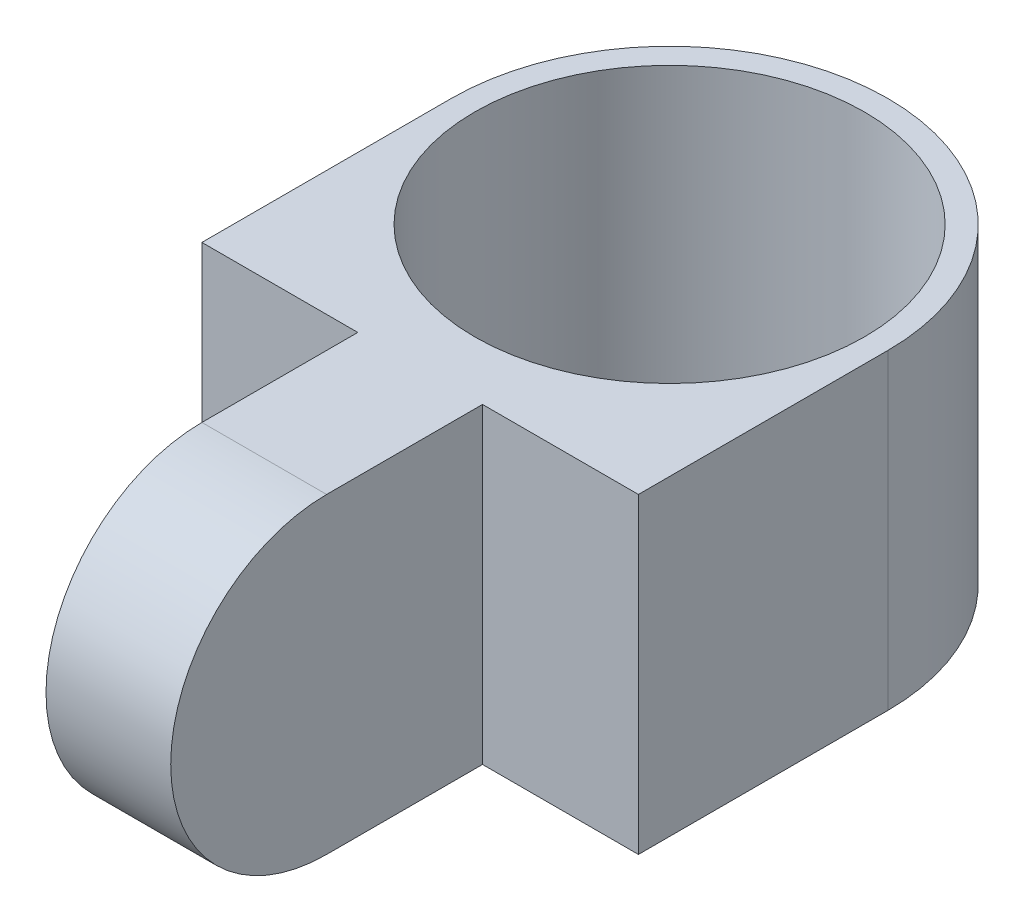
ISO-10303-21;
HEADER;
FILE_DESCRIPTION(('STEP AP214'),'2;1');
FILE_NAME('part.step','',(''),(''),'','','');
FILE_SCHEMA(('AUTOMOTIVE_DESIGN { 1 0 10303 214 1 1 1 1 }'));
ENDSEC;
DATA;
#1=APPLICATION_CONTEXT('core data for automotive mechanical design processes');
#2=APPLICATION_PROTOCOL_DEFINITION('international standard','automotive_design',2000,#1);
#3=PRODUCT_CONTEXT('',#1,'mechanical');
#4=PRODUCT('Part','Part','',(#3));
#5=PRODUCT_RELATED_PRODUCT_CATEGORY('part','',(#4));
#6=PRODUCT_DEFINITION_FORMATION('','',#4);
#7=PRODUCT_DEFINITION_CONTEXT('part definition',#1,'design');
#8=PRODUCT_DEFINITION('design','',#6,#7);
#9=PRODUCT_DEFINITION_SHAPE('','',#8);
#10=(LENGTH_UNIT() NAMED_UNIT(*) SI_UNIT(.MILLI.,.METRE.));
#11=(NAMED_UNIT(*) PLANE_ANGLE_UNIT() SI_UNIT($,.RADIAN.));
#12=(NAMED_UNIT(*) SI_UNIT($,.STERADIAN.) SOLID_ANGLE_UNIT());
#13=UNCERTAINTY_MEASURE_WITH_UNIT(LENGTH_MEASURE(1.E-05),#10,'distance_accuracy_value','');
#14=(GEOMETRIC_REPRESENTATION_CONTEXT(3) GLOBAL_UNCERTAINTY_ASSIGNED_CONTEXT((#13)) GLOBAL_UNIT_ASSIGNED_CONTEXT((#10,
#11,#12)) REPRESENTATION_CONTEXT('',''));
#15=CARTESIAN_POINT('',(0.,0.,0.));
#16=DIRECTION('',(0.,0.,1.));
#17=DIRECTION('',(1.,0.,0.));
#18=AXIS2_PLACEMENT_3D('',#15,#16,#17);
#19=CARTESIAN_POINT('',(0.,0.,8.));
#20=DIRECTION('',(0.,0.,1.));
#21=DIRECTION('',(1.,0.,0.));
#22=AXIS2_PLACEMENT_3D('',#19,#20,#21);
#23=PLANE('',#22);
#24=DIRECTION('',(1.,0.,0.));
#25=VECTOR('',#24,1.);
#26=CARTESIAN_POINT('',(-7.,0.,8.));
#27=LINE('',#26,#25);
#28=CARTESIAN_POINT('',(-7.,0.,8.));
#29=VERTEX_POINT('',#28);
#30=CARTESIAN_POINT('',(-2.,0.,8.));
#31=VERTEX_POINT('',#30);
#32=EDGE_CURVE('E222',#29,#31,#27,.T.);
#33=ORIENTED_EDGE('',*,*,#32,.T.);
#34=DIRECTION('',(0.,1.,0.));
#35=VECTOR('',#34,1.);
#36=CARTESIAN_POINT('',(-2.,10.,8.));
#37=LINE('',#36,#35);
#38=CARTESIAN_POINT('',(-2.,10.,8.));
#39=VERTEX_POINT('',#38);
#40=EDGE_CURVE('E227',#31,#39,#37,.T.);
#41=ORIENTED_EDGE('',*,*,#40,.T.);
#42=DIRECTION('',(-1.,0.,0.));
#43=VECTOR('',#42,1.);
#44=CARTESIAN_POINT('',(-7.,10.,8.));
#45=LINE('',#44,#43);
#46=CARTESIAN_POINT('',(-7.,10.,8.));
#47=VERTEX_POINT('',#46);
#48=EDGE_CURVE('E137',#39,#47,#45,.T.);
#49=ORIENTED_EDGE('',*,*,#48,.T.);
#50=DIRECTION('',(0.,-1.,0.));
#51=VECTOR('',#50,1.);
#52=CARTESIAN_POINT('',(-7.,10.,8.));
#53=LINE('',#52,#51);
#54=EDGE_CURVE('E155',#47,#29,#53,.T.);
#55=ORIENTED_EDGE('',*,*,#54,.T.);
#56=EDGE_LOOP('',(#33,#41,#49,#55));
#57=FACE_BOUND('',#56,.T.);
#58=ADVANCED_FACE('F43',(#57),#23,.T.);
#59=CARTESIAN_POINT('',(0.,10.,0.));
#60=DIRECTION('',(0.,-1.,0.));
#61=DIRECTION('',(0.,0.,-1.));
#62=AXIS2_PLACEMENT_3D('',#59,#60,#61);
#63=CYLINDRICAL_SURFACE('',#62,7.);
#64=DIRECTION('',(0.,-1.,0.));
#65=VECTOR('',#64,1.);
#66=CARTESIAN_POINT('',(-7.,10.,0.));
#67=LINE('',#66,#65);
#68=CARTESIAN_POINT('',(-7.,10.,0.));
#69=VERTEX_POINT('',#68);
#70=CARTESIAN_POINT('',(-7.,0.,0.));
#71=VERTEX_POINT('',#70);
#72=EDGE_CURVE('E147',#69,#71,#67,.T.);
#73=ORIENTED_EDGE('',*,*,#72,.F.);
#74=CARTESIAN_POINT('',(0.,10.,0.));
#75=DIRECTION('',(0.,1.,0.));
#76=DIRECTION('',(0.,0.,1.));
#77=AXIS2_PLACEMENT_3D('',#74,#75,#76);
#78=CIRCLE('',#77,7.);
#79=CARTESIAN_POINT('',(7.,10.,0.));
#80=VERTEX_POINT('',#79);
#81=EDGE_CURVE('E11',#80,#69,#78,.T.);
#82=ORIENTED_EDGE('',*,*,#81,.F.);
#83=DIRECTION('',(0.,1.,0.));
#84=VECTOR('',#83,1.);
#85=CARTESIAN_POINT('',(7.,10.,0.));
#86=LINE('',#85,#84);
#87=CARTESIAN_POINT('',(7.,0.,0.));
#88=VERTEX_POINT('',#87);
#89=EDGE_CURVE('E151',#88,#80,#86,.T.);
#90=ORIENTED_EDGE('',*,*,#89,.F.);
#91=CARTESIAN_POINT('',(0.,0.,0.));
#92=DIRECTION('',(0.,1.,0.));
#93=DIRECTION('',(0.,0.,1.));
#94=AXIS2_PLACEMENT_3D('',#91,#92,#93);
#95=CIRCLE('',#94,7.);
#96=EDGE_CURVE('E47',#88,#71,#95,.T.);
#97=ORIENTED_EDGE('',*,*,#96,.T.);
#98=EDGE_LOOP('',(#73,#82,#90,#97));
#99=FACE_BOUND('',#98,.T.);
#100=ADVANCED_FACE('F45',(#99),#63,.T.);
#101=CARTESIAN_POINT('',(0.,10.,0.));
#102=DIRECTION('',(0.,-1.,0.));
#103=DIRECTION('',(0.,0.,-1.));
#104=AXIS2_PLACEMENT_3D('',#101,#102,#103);
#105=CYLINDRICAL_SURFACE('',#104,6.25);
#106=CARTESIAN_POINT('',(0.,10.,0.));
#107=DIRECTION('',(0.,1.,0.));
#108=DIRECTION('',(0.,0.,1.));
#109=AXIS2_PLACEMENT_3D('',#106,#107,#108);
#110=CIRCLE('',#109,6.25);
#111=CARTESIAN_POINT('',(0.,10.,6.25));
#112=VERTEX_POINT('',#111);
#113=EDGE_CURVE('E167',#112,#112,#110,.T.);
#114=ORIENTED_EDGE('',*,*,#113,.T.);
#115=EDGE_LOOP('',(#114));
#116=FACE_BOUND('',#115,.T.);
#117=CARTESIAN_POINT('',(0.,0.,0.));
#118=DIRECTION('',(0.,1.,0.));
#119=DIRECTION('',(0.,0.,1.));
#120=AXIS2_PLACEMENT_3D('',#117,#118,#119);
#121=CIRCLE('',#120,6.25);
#122=CARTESIAN_POINT('',(0.,0.,6.25));
#123=VERTEX_POINT('',#122);
#124=EDGE_CURVE('E166',#123,#123,#121,.T.);
#125=ORIENTED_EDGE('',*,*,#124,.F.);
#126=EDGE_LOOP('',(#125));
#127=FACE_BOUND('',#126,.T.);
#128=ADVANCED_FACE('F178',(#116,#127),#105,.F.);
#129=CARTESIAN_POINT('',(0.,10.,0.));
#130=DIRECTION('',(0.,1.,0.));
#131=DIRECTION('',(0.,0.,1.));
#132=AXIS2_PLACEMENT_3D('',#129,#130,#131);
#133=PLANE('',#132);
#134=ORIENTED_EDGE('',*,*,#113,.F.);
#135=EDGE_LOOP('',(#134));
#136=FACE_BOUND('',#135,.T.);
#137=ORIENTED_EDGE('',*,*,#81,.T.);
#138=DIRECTION('',(0.,0.,-1.));
#139=VECTOR('',#138,1.);
#140=CARTESIAN_POINT('',(-7.,10.,8.));
#141=LINE('',#140,#139);
#142=EDGE_CURVE('E136',#47,#69,#141,.T.);
#143=ORIENTED_EDGE('',*,*,#142,.F.);
#144=ORIENTED_EDGE('',*,*,#48,.F.);
#145=DIRECTION('',(0.,0.,1.));
#146=VECTOR('',#145,1.);
#147=CARTESIAN_POINT('',(-2.,10.,8.));
#148=LINE('',#147,#146);
#149=CARTESIAN_POINT('',(-2.,10.,13.));
#150=VERTEX_POINT('',#149);
#151=EDGE_CURVE('E59',#39,#150,#148,.T.);
#152=ORIENTED_EDGE('',*,*,#151,.T.);
#153=DIRECTION('',(1.,0.,0.));
#154=VECTOR('',#153,1.);
#155=CARTESIAN_POINT('',(-2.,10.,13.));
#156=LINE('',#155,#154);
#157=CARTESIAN_POINT('',(2.,10.,13.));
#158=VERTEX_POINT('',#157);
#159=EDGE_CURVE('E115',#150,#158,#156,.T.);
#160=ORIENTED_EDGE('',*,*,#159,.T.);
#161=DIRECTION('',(0.,0.,1.));
#162=VECTOR('',#161,1.);
#163=CARTESIAN_POINT('',(2.,10.,8.));
#164=LINE('',#163,#162);
#165=CARTESIAN_POINT('',(2.,10.,8.));
#166=VERTEX_POINT('',#165);
#167=EDGE_CURVE('E109',#166,#158,#164,.T.);
#168=ORIENTED_EDGE('',*,*,#167,.F.);
#169=CARTESIAN_POINT('',(7.,10.,8.));
#170=VERTEX_POINT('',#169);
#171=EDGE_CURVE('E114',#170,#166,#45,.T.);
#172=ORIENTED_EDGE('',*,*,#171,.F.);
#173=DIRECTION('',(0.,0.,-1.));
#174=VECTOR('',#173,1.);
#175=CARTESIAN_POINT('',(7.,10.,8.));
#176=LINE('',#175,#174);
#177=EDGE_CURVE('E142',#170,#80,#176,.T.);
#178=ORIENTED_EDGE('',*,*,#177,.T.);
#179=EDGE_LOOP('',(#137,#143,#144,#152,#160,#168,#172,#178));
#180=FACE_BOUND('',#179,.T.);
#181=ADVANCED_FACE('F111',(#136,#180),#133,.T.);
#182=CARTESIAN_POINT('',(0.,0.,0.));
#183=DIRECTION('',(0.,1.,0.));
#184=DIRECTION('',(0.,0.,1.));
#185=AXIS2_PLACEMENT_3D('',#182,#183,#184);
#186=PLANE('',#185);
#187=ORIENTED_EDGE('',*,*,#124,.T.);
#188=EDGE_LOOP('',(#187));
#189=FACE_BOUND('',#188,.T.);
#190=DIRECTION('',(0.,0.,-1.));
#191=VECTOR('',#190,1.);
#192=CARTESIAN_POINT('',(-7.,0.,8.));
#193=LINE('',#192,#191);
#194=EDGE_CURVE('E163',#29,#71,#193,.T.);
#195=ORIENTED_EDGE('',*,*,#194,.T.);
#196=ORIENTED_EDGE('',*,*,#96,.F.);
#197=DIRECTION('',(0.,0.,-1.));
#198=VECTOR('',#197,1.);
#199=CARTESIAN_POINT('',(7.,0.,8.));
#200=LINE('',#199,#198);
#201=CARTESIAN_POINT('',(7.,0.,8.));
#202=VERTEX_POINT('',#201);
#203=EDGE_CURVE('E159',#202,#88,#200,.T.);
#204=ORIENTED_EDGE('',*,*,#203,.F.);
#205=CARTESIAN_POINT('',(2.,0.,8.));
#206=VERTEX_POINT('',#205);
#207=EDGE_CURVE('E219',#206,#202,#27,.T.);
#208=ORIENTED_EDGE('',*,*,#207,.F.);
#209=DIRECTION('',(0.,0.,-1.));
#210=VECTOR('',#209,1.);
#211=CARTESIAN_POINT('',(2.,0.,8.));
#212=LINE('',#211,#210);
#213=CARTESIAN_POINT('',(2.,0.,13.));
#214=VERTEX_POINT('',#213);
#215=EDGE_CURVE('E126',#214,#206,#212,.T.);
#216=ORIENTED_EDGE('',*,*,#215,.F.);
#217=DIRECTION('',(1.,0.,0.));
#218=VECTOR('',#217,1.);
#219=CARTESIAN_POINT('',(-2.,0.,13.));
#220=LINE('',#219,#218);
#221=CARTESIAN_POINT('',(-2.,0.,13.));
#222=VERTEX_POINT('',#221);
#223=EDGE_CURVE('E152',#222,#214,#220,.T.);
#224=ORIENTED_EDGE('',*,*,#223,.F.);
#225=DIRECTION('',(0.,0.,-1.));
#226=VECTOR('',#225,1.);
#227=CARTESIAN_POINT('',(-2.,0.,8.));
#228=LINE('',#227,#226);
#229=EDGE_CURVE('E230',#222,#31,#228,.T.);
#230=ORIENTED_EDGE('',*,*,#229,.T.);
#231=ORIENTED_EDGE('',*,*,#32,.F.);
#232=EDGE_LOOP('',(#195,#196,#204,#208,#216,#224,#230,#231));
#233=FACE_BOUND('',#232,.T.);
#234=ADVANCED_FACE('F175',(#189,#233),#186,.F.);
#235=CARTESIAN_POINT('',(-7.,10.,8.));
#236=DIRECTION('',(1.,0.,0.));
#237=DIRECTION('',(0.,0.,-1.));
#238=AXIS2_PLACEMENT_3D('',#235,#236,#237);
#239=PLANE('',#238);
#240=ORIENTED_EDGE('',*,*,#72,.T.);
#241=ORIENTED_EDGE('',*,*,#194,.F.);
#242=ORIENTED_EDGE('',*,*,#54,.F.);
#243=ORIENTED_EDGE('',*,*,#142,.T.);
#244=EDGE_LOOP('',(#240,#241,#242,#243));
#245=FACE_BOUND('',#244,.T.);
#246=ADVANCED_FACE('F206',(#245),#239,.F.);
#247=CARTESIAN_POINT('',(7.,10.,8.));
#248=DIRECTION('',(-1.,0.,0.));
#249=DIRECTION('',(0.,0.,1.));
#250=AXIS2_PLACEMENT_3D('',#247,#248,#249);
#251=PLANE('',#250);
#252=ORIENTED_EDGE('',*,*,#89,.T.);
#253=ORIENTED_EDGE('',*,*,#177,.F.);
#254=DIRECTION('',(0.,1.,0.));
#255=VECTOR('',#254,1.);
#256=CARTESIAN_POINT('',(7.,10.,8.));
#257=LINE('',#256,#255);
#258=EDGE_CURVE('E133',#202,#170,#257,.T.);
#259=ORIENTED_EDGE('',*,*,#258,.F.);
#260=ORIENTED_EDGE('',*,*,#203,.T.);
#261=EDGE_LOOP('',(#252,#253,#259,#260));
#262=FACE_BOUND('',#261,.T.);
#263=ADVANCED_FACE('F199',(#262),#251,.F.);
#264=DIRECTION('',(0.,1.,0.));
#265=VECTOR('',#264,1.);
#266=CARTESIAN_POINT('',(2.,10.,8.));
#267=LINE('',#266,#265);
#268=EDGE_CURVE('E121',#206,#166,#267,.T.);
#269=ORIENTED_EDGE('',*,*,#268,.F.);
#270=ORIENTED_EDGE('',*,*,#207,.T.);
#271=ORIENTED_EDGE('',*,*,#258,.T.);
#272=ORIENTED_EDGE('',*,*,#171,.T.);
#273=EDGE_LOOP('',(#269,#270,#271,#272));
#274=FACE_BOUND('',#273,.T.);
#275=ADVANCED_FACE('F131',(#274),#23,.T.);
#276=CARTESIAN_POINT('',(-2.,5.,13.));
#277=DIRECTION('',(1.,0.,0.));
#278=DIRECTION('',(0.,0.,-1.));
#279=AXIS2_PLACEMENT_3D('',#276,#277,#278);
#280=CYLINDRICAL_SURFACE('',#279,5.);
#281=ORIENTED_EDGE('',*,*,#223,.T.);
#282=CARTESIAN_POINT('',(2.,5.,13.));
#283=DIRECTION('',(1.,0.,0.));
#284=DIRECTION('',(0.,0.,-1.));
#285=AXIS2_PLACEMENT_3D('',#282,#283,#284);
#286=CIRCLE('',#285,5.);
#287=EDGE_CURVE('E120',#158,#214,#286,.T.);
#288=ORIENTED_EDGE('',*,*,#287,.F.);
#289=ORIENTED_EDGE('',*,*,#159,.F.);
#290=CARTESIAN_POINT('',(-2.,5.,13.));
#291=DIRECTION('',(1.,0.,0.));
#292=DIRECTION('',(0.,0.,-1.));
#293=AXIS2_PLACEMENT_3D('',#290,#291,#292);
#294=CIRCLE('',#293,5.);
#295=EDGE_CURVE('E233',#150,#222,#294,.T.);
#296=ORIENTED_EDGE('',*,*,#295,.T.);
#297=EDGE_LOOP('',(#281,#288,#289,#296));
#298=FACE_BOUND('',#297,.T.);
#299=ADVANCED_FACE('F198',(#298),#280,.T.);
#300=CARTESIAN_POINT('',(-2.,5.,13.));
#301=DIRECTION('',(1.,0.,0.));
#302=DIRECTION('',(0.,0.,-1.));
#303=AXIS2_PLACEMENT_3D('',#300,#301,#302);
#304=PLANE('',#303);
#305=ORIENTED_EDGE('',*,*,#40,.F.);
#306=ORIENTED_EDGE('',*,*,#229,.F.);
#307=ORIENTED_EDGE('',*,*,#295,.F.);
#308=ORIENTED_EDGE('',*,*,#151,.F.);
#309=EDGE_LOOP('',(#305,#306,#307,#308));
#310=FACE_BOUND('',#309,.T.);
#311=ADVANCED_FACE('F204',(#310),#304,.F.);
#312=CARTESIAN_POINT('',(2.,5.,13.));
#313=DIRECTION('',(1.,0.,0.));
#314=DIRECTION('',(0.,0.,-1.));
#315=AXIS2_PLACEMENT_3D('',#312,#313,#314);
#316=PLANE('',#315);
#317=ORIENTED_EDGE('',*,*,#268,.T.);
#318=ORIENTED_EDGE('',*,*,#167,.T.);
#319=ORIENTED_EDGE('',*,*,#287,.T.);
#320=ORIENTED_EDGE('',*,*,#215,.T.);
#321=EDGE_LOOP('',(#317,#318,#319,#320));
#322=FACE_BOUND('',#321,.T.);
#323=ADVANCED_FACE('F124',(#322),#316,.T.);
#324=CLOSED_SHELL('',(#58,#100,#128,#181,#234,#246,#263,#275,#299,#311,#323));
#325=MANIFOLD_SOLID_BREP('B2',#324);
#326=ADVANCED_BREP_SHAPE_REPRESENTATION('',(#18,#325),#14);
#327=SHAPE_DEFINITION_REPRESENTATION(#9,#326);
ENDSEC;
END-ISO-10303-21;
